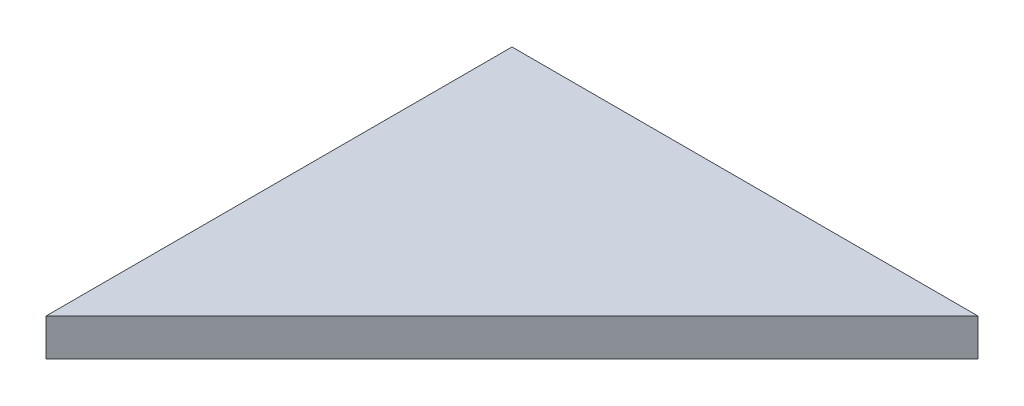
ISO-10303-21;
HEADER;
FILE_DESCRIPTION(('STEP AP214'),'2;1');
FILE_NAME('part.step','',(''),(''),'','','');
FILE_SCHEMA(('AUTOMOTIVE_DESIGN { 1 0 10303 214 1 1 1 1 }'));
ENDSEC;
DATA;
#1=APPLICATION_CONTEXT('core data for automotive mechanical design processes');
#2=APPLICATION_PROTOCOL_DEFINITION('international standard','automotive_design',2000,#1);
#3=PRODUCT_CONTEXT('',#1,'mechanical');
#4=PRODUCT('Part','Part','',(#3));
#5=PRODUCT_RELATED_PRODUCT_CATEGORY('part','',(#4));
#6=PRODUCT_DEFINITION_FORMATION('','',#4);
#7=PRODUCT_DEFINITION_CONTEXT('part definition',#1,'design');
#8=PRODUCT_DEFINITION('design','',#6,#7);
#9=PRODUCT_DEFINITION_SHAPE('','',#8);
#10=(LENGTH_UNIT() NAMED_UNIT(*) SI_UNIT(.MILLI.,.METRE.));
#11=(NAMED_UNIT(*) PLANE_ANGLE_UNIT() SI_UNIT($,.RADIAN.));
#12=(NAMED_UNIT(*) SI_UNIT($,.STERADIAN.) SOLID_ANGLE_UNIT());
#13=UNCERTAINTY_MEASURE_WITH_UNIT(LENGTH_MEASURE(1.E-05),#10,'distance_accuracy_value','');
#14=(GEOMETRIC_REPRESENTATION_CONTEXT(3) GLOBAL_UNCERTAINTY_ASSIGNED_CONTEXT((#13)) GLOBAL_UNIT_ASSIGNED_CONTEXT((#10,
#11,#12)) REPRESENTATION_CONTEXT('',''));
#15=CARTESIAN_POINT('',(0.,0.,0.));
#16=DIRECTION('',(0.,0.,1.));
#17=DIRECTION('',(1.,0.,0.));
#18=AXIS2_PLACEMENT_3D('',#15,#16,#17);
#19=CARTESIAN_POINT('',(0.,6.4,-100.));
#20=DIRECTION('',(0.,0.,-1.));
#21=DIRECTION('',(-1.,0.,0.));
#22=AXIS2_PLACEMENT_3D('',#19,#20,#21);
#23=PLANE('',#22);
#24=DIRECTION('',(1.,0.,0.));
#25=VECTOR('',#24,1.);
#26=CARTESIAN_POINT('',(0.,0.,-100.));
#27=LINE('',#26,#25);
#28=CARTESIAN_POINT('',(0.,0.,-100.));
#29=VERTEX_POINT('',#28);
#30=CARTESIAN_POINT('',(80.,0.,-100.));
#31=VERTEX_POINT('',#30);
#32=EDGE_CURVE('E72',#29,#31,#27,.T.);
#33=ORIENTED_EDGE('',*,*,#32,.F.);
#34=DIRECTION('',(0.,-1.,0.));
#35=VECTOR('',#34,1.);
#36=CARTESIAN_POINT('',(0.,6.4,-100.));
#37=LINE('',#36,#35);
#38=CARTESIAN_POINT('',(0.,6.4,-100.));
#39=VERTEX_POINT('',#38);
#40=EDGE_CURVE('E11',#39,#29,#37,.T.);
#41=ORIENTED_EDGE('',*,*,#40,.F.);
#42=DIRECTION('',(1.,0.,0.));
#43=VECTOR('',#42,1.);
#44=CARTESIAN_POINT('',(0.,6.4,-100.));
#45=LINE('',#44,#43);
#46=CARTESIAN_POINT('',(80.,6.4,-100.));
#47=VERTEX_POINT('',#46);
#48=EDGE_CURVE('E70',#39,#47,#45,.T.);
#49=ORIENTED_EDGE('',*,*,#48,.T.);
#50=DIRECTION('',(0.,-1.,0.));
#51=VECTOR('',#50,1.);
#52=CARTESIAN_POINT('',(80.,6.4,-100.));
#53=LINE('',#52,#51);
#54=EDGE_CURVE('E68',#47,#31,#53,.T.);
#55=ORIENTED_EDGE('',*,*,#54,.T.);
#56=EDGE_LOOP('',(#33,#41,#49,#55));
#57=FACE_BOUND('',#56,.T.);
#58=ADVANCED_FACE('F35',(#57),#23,.T.);
#59=CARTESIAN_POINT('',(0.,6.4,0.));
#60=DIRECTION('',(-1.,0.,0.));
#61=DIRECTION('',(0.,0.,1.));
#62=AXIS2_PLACEMENT_3D('',#59,#60,#61);
#63=PLANE('',#62);
#64=DIRECTION('',(0.,0.,-1.));
#65=VECTOR('',#64,1.);
#66=CARTESIAN_POINT('',(0.,0.,0.));
#67=LINE('',#66,#65);
#68=CARTESIAN_POINT('',(0.,0.,-20.));
#69=VERTEX_POINT('',#68);
#70=EDGE_CURVE('E86',#69,#29,#67,.T.);
#71=ORIENTED_EDGE('',*,*,#70,.F.);
#72=DIRECTION('',(0.,-1.,0.));
#73=VECTOR('',#72,1.);
#74=CARTESIAN_POINT('',(0.,6.4,-20.));
#75=LINE('',#74,#73);
#76=CARTESIAN_POINT('',(0.,6.4,-20.));
#77=VERTEX_POINT('',#76);
#78=EDGE_CURVE('E43',#77,#69,#75,.T.);
#79=ORIENTED_EDGE('',*,*,#78,.F.);
#80=DIRECTION('',(0.,0.,-1.));
#81=VECTOR('',#80,1.);
#82=CARTESIAN_POINT('',(0.,6.4,0.));
#83=LINE('',#82,#81);
#84=EDGE_CURVE('E78',#77,#39,#83,.T.);
#85=ORIENTED_EDGE('',*,*,#84,.T.);
#86=ORIENTED_EDGE('',*,*,#40,.T.);
#87=EDGE_LOOP('',(#71,#79,#85,#86));
#88=FACE_BOUND('',#87,.T.);
#89=ADVANCED_FACE('F81',(#88),#63,.T.);
#90=CARTESIAN_POINT('',(-10.,6.4,-10.));
#91=DIRECTION('',(-0.707106781186548,0.,-0.707106781186548));
#92=DIRECTION('',(-0.707106781186548,0.,0.707106781186548));
#93=AXIS2_PLACEMENT_3D('',#90,#91,#92);
#94=PLANE('',#93);
#95=DIRECTION('',(0.707106781186548,0.,-0.707106781186548));
#96=VECTOR('',#95,1.);
#97=CARTESIAN_POINT('',(-10.,0.,-10.));
#98=LINE('',#97,#96);
#99=EDGE_CURVE('E79',#69,#31,#98,.T.);
#100=ORIENTED_EDGE('',*,*,#99,.T.);
#101=ORIENTED_EDGE('',*,*,#54,.F.);
#102=DIRECTION('',(0.707106781186548,0.,-0.707106781186548));
#103=VECTOR('',#102,1.);
#104=CARTESIAN_POINT('',(-10.,6.4,-10.));
#105=LINE('',#104,#103);
#106=EDGE_CURVE('E51',#77,#47,#105,.T.);
#107=ORIENTED_EDGE('',*,*,#106,.F.);
#108=ORIENTED_EDGE('',*,*,#78,.T.);
#109=EDGE_LOOP('',(#100,#101,#107,#108));
#110=FACE_BOUND('',#109,.T.);
#111=ADVANCED_FACE('F89',(#110),#94,.F.);
#112=CARTESIAN_POINT('',(0.,6.4,0.));
#113=DIRECTION('',(0.,1.,0.));
#114=DIRECTION('',(0.,0.,1.));
#115=AXIS2_PLACEMENT_3D('',#112,#113,#114);
#116=PLANE('',#115);
#117=ORIENTED_EDGE('',*,*,#48,.F.);
#118=ORIENTED_EDGE('',*,*,#84,.F.);
#119=ORIENTED_EDGE('',*,*,#106,.T.);
#120=EDGE_LOOP('',(#117,#118,#119));
#121=FACE_BOUND('',#120,.T.);
#122=ADVANCED_FACE('F77',(#121),#116,.T.);
#123=CARTESIAN_POINT('',(0.,0.,0.));
#124=DIRECTION('',(0.,1.,0.));
#125=DIRECTION('',(0.,0.,1.));
#126=AXIS2_PLACEMENT_3D('',#123,#124,#125);
#127=PLANE('',#126);
#128=ORIENTED_EDGE('',*,*,#32,.T.);
#129=ORIENTED_EDGE('',*,*,#99,.F.);
#130=ORIENTED_EDGE('',*,*,#70,.T.);
#131=EDGE_LOOP('',(#128,#129,#130));
#132=FACE_BOUND('',#131,.T.);
#133=ADVANCED_FACE('F91',(#132),#127,.F.);
#134=CLOSED_SHELL('',(#58,#89,#111,#122,#133));
#135=MANIFOLD_SOLID_BREP('B2',#134);
#136=ADVANCED_BREP_SHAPE_REPRESENTATION('',(#18,#135),#14);
#137=SHAPE_DEFINITION_REPRESENTATION(#9,#136);
ENDSEC;
END-ISO-10303-21;
